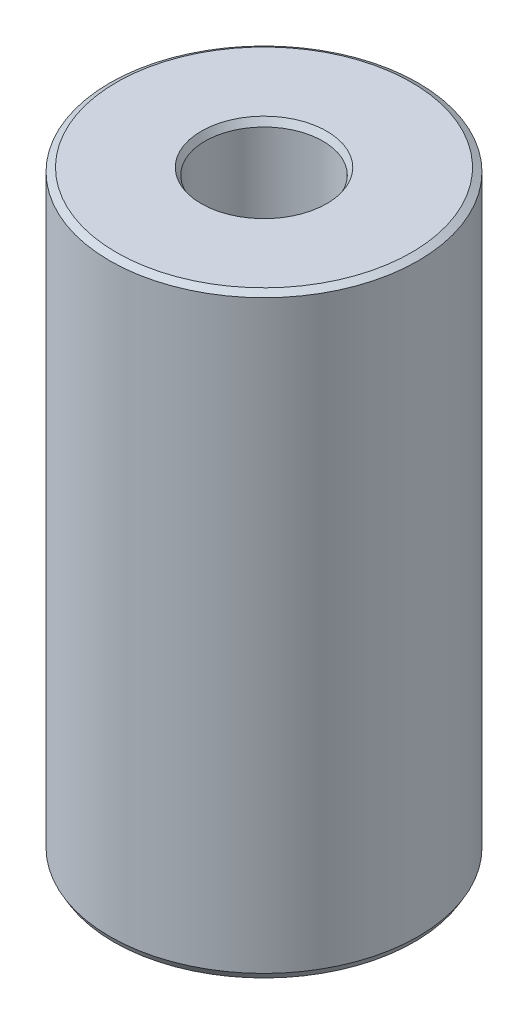
ISO-10303-21;
HEADER;
FILE_DESCRIPTION(('STEP AP214'),'2;1');
FILE_NAME('part.step','',(''),(''),'','','');
FILE_SCHEMA(('AUTOMOTIVE_DESIGN { 1 0 10303 214 1 1 1 1 }'));
ENDSEC;
DATA;
#1=APPLICATION_CONTEXT('core data for automotive mechanical design processes');
#2=APPLICATION_PROTOCOL_DEFINITION('international standard','automotive_design',2000,#1);
#3=PRODUCT_CONTEXT('',#1,'mechanical');
#4=PRODUCT('Part','Part','',(#3));
#5=PRODUCT_RELATED_PRODUCT_CATEGORY('part','',(#4));
#6=PRODUCT_DEFINITION_FORMATION('','',#4);
#7=PRODUCT_DEFINITION_CONTEXT('part definition',#1,'design');
#8=PRODUCT_DEFINITION('design','',#6,#7);
#9=PRODUCT_DEFINITION_SHAPE('','',#8);
#10=(LENGTH_UNIT() NAMED_UNIT(*) SI_UNIT(.MILLI.,.METRE.));
#11=(NAMED_UNIT(*) PLANE_ANGLE_UNIT() SI_UNIT($,.RADIAN.));
#12=(NAMED_UNIT(*) SI_UNIT($,.STERADIAN.) SOLID_ANGLE_UNIT());
#13=UNCERTAINTY_MEASURE_WITH_UNIT(LENGTH_MEASURE(1.E-05),#10,'distance_accuracy_value','');
#14=(GEOMETRIC_REPRESENTATION_CONTEXT(3) GLOBAL_UNCERTAINTY_ASSIGNED_CONTEXT((#13)) GLOBAL_UNIT_ASSIGNED_CONTEXT((#10,
#11,#12)) REPRESENTATION_CONTEXT('',''));
#15=CARTESIAN_POINT('',(0.,0.,0.));
#16=DIRECTION('',(0.,0.,1.));
#17=DIRECTION('',(1.,0.,0.));
#18=AXIS2_PLACEMENT_3D('',#15,#16,#17);
#19=CARTESIAN_POINT('',(0.,38.6476704867657,0.));
#20=DIRECTION('',(0.,-1.,0.));
#21=DIRECTION('',(0.,0.,-1.));
#22=AXIS2_PLACEMENT_3D('',#19,#20,#21);
#23=CYLINDRICAL_SURFACE('',#22,10.);
#24=CARTESIAN_POINT('',(0.,0.433010156777346,0.));
#25=DIRECTION('',(0.,1.,0.));
#26=DIRECTION('',(0.,0.,1.));
#27=AXIS2_PLACEMENT_3D('',#24,#25,#26);
#28=CIRCLE('',#27,10.);
#29=CARTESIAN_POINT('',(0.,0.433010156777346,10.));
#30=VERTEX_POINT('',#29);
#31=EDGE_CURVE('E10',#30,#30,#28,.T.);
#32=ORIENTED_EDGE('',*,*,#31,.T.);
#33=EDGE_LOOP('',(#32));
#34=FACE_BOUND('',#33,.T.);
#35=CARTESIAN_POINT('',(0.,38.3976719561885,0.));
#36=DIRECTION('',(0.,1.,0.));
#37=DIRECTION('',(0.,0.,1.));
#38=AXIS2_PLACEMENT_3D('',#35,#36,#37);
#39=CIRCLE('',#38,10.);
#40=CARTESIAN_POINT('',(0.,38.3976719561885,10.));
#41=VERTEX_POINT('',#40);
#42=EDGE_CURVE('E50',#41,#41,#39,.F.);
#43=ORIENTED_EDGE('',*,*,#42,.T.);
#44=EDGE_LOOP('',(#43));
#45=FACE_BOUND('',#44,.T.);
#46=ADVANCED_FACE('F39',(#34,#45),#23,.T.);
#47=CARTESIAN_POINT('',(0.,38.6476704867657,0.));
#48=DIRECTION('',(0.,1.,0.));
#49=DIRECTION('',(0.,0.,1.));
#50=AXIS2_PLACEMENT_3D('',#47,#48,#49);
#51=PLANE('',#50);
#52=CARTESIAN_POINT('',(0.,38.6476704867657,0.));
#53=DIRECTION('',(0.,1.,0.));
#54=DIRECTION('',(0.,0.,1.));
#55=AXIS2_PLACEMENT_3D('',#52,#53,#54);
#56=CIRCLE('',#55,4.07374202861867);
#57=CARTESIAN_POINT('',(0.,38.6476704867657,4.07374202861867));
#58=VERTEX_POINT('',#57);
#59=EDGE_CURVE('E58',#58,#58,#56,.F.);
#60=ORIENTED_EDGE('',*,*,#59,.T.);
#61=EDGE_LOOP('',(#60));
#62=FACE_BOUND('',#61,.T.);
#63=CARTESIAN_POINT('',(0.,38.6476704867657,0.));
#64=DIRECTION('',(0.,1.,0.));
#65=DIRECTION('',(0.,0.,1.));
#66=AXIS2_PLACEMENT_3D('',#63,#64,#65);
#67=CIRCLE('',#66,9.56698984322266);
#68=CARTESIAN_POINT('',(0.,38.6476704867657,9.56698984322266));
#69=VERTEX_POINT('',#68);
#70=EDGE_CURVE('E61',#69,#69,#67,.T.);
#71=ORIENTED_EDGE('',*,*,#70,.T.);
#72=EDGE_LOOP('',(#71));
#73=FACE_BOUND('',#72,.T.);
#74=ADVANCED_FACE('F88',(#62,#73),#51,.T.);
#75=CARTESIAN_POINT('',(0.,0.,0.));
#76=DIRECTION('',(0.,1.,0.));
#77=DIRECTION('',(0.,0.,1.));
#78=AXIS2_PLACEMENT_3D('',#75,#76,#77);
#79=PLANE('',#78);
#80=CARTESIAN_POINT('',(0.,0.,0.));
#81=DIRECTION('',(0.,1.,0.));
#82=DIRECTION('',(0.,0.,1.));
#83=AXIS2_PLACEMENT_3D('',#80,#81,#82);
#84=CIRCLE('',#83,4.25675365481877);
#85=CARTESIAN_POINT('',(0.,0.,4.25675365481877));
#86=VERTEX_POINT('',#85);
#87=EDGE_CURVE('E51',#86,#86,#84,.T.);
#88=ORIENTED_EDGE('',*,*,#87,.T.);
#89=EDGE_LOOP('',(#88));
#90=FACE_BOUND('',#89,.T.);
#91=CARTESIAN_POINT('',(0.,0.,0.));
#92=DIRECTION('',(0.,1.,0.));
#93=DIRECTION('',(0.,0.,1.));
#94=AXIS2_PLACEMENT_3D('',#91,#92,#93);
#95=CIRCLE('',#94,9.75000146942276);
#96=CARTESIAN_POINT('',(0.,0.,9.75000146942276));
#97=VERTEX_POINT('',#96);
#98=EDGE_CURVE('E54',#97,#97,#95,.F.);
#99=ORIENTED_EDGE('',*,*,#98,.T.);
#100=EDGE_LOOP('',(#99));
#101=FACE_BOUND('',#100,.T.);
#102=ADVANCED_FACE('F83',(#90,#101),#79,.F.);
#103=CARTESIAN_POINT('',(0.,38.6476704867657,0.));
#104=DIRECTION('',(0.,-1.,0.));
#105=DIRECTION('',(0.,0.,-1.));
#106=AXIS2_PLACEMENT_3D('',#103,#104,#105);
#107=CYLINDRICAL_SURFACE('',#106,3.82374349804143);
#108=CARTESIAN_POINT('',(0.,38.2146603299883,0.));
#109=DIRECTION('',(0.,1.,0.));
#110=DIRECTION('',(0.,0.,1.));
#111=AXIS2_PLACEMENT_3D('',#108,#109,#110);
#112=CIRCLE('',#111,3.82374349804143);
#113=CARTESIAN_POINT('',(0.,38.2146603299883,3.82374349804143));
#114=VERTEX_POINT('',#113);
#115=EDGE_CURVE('E67',#114,#114,#112,.T.);
#116=ORIENTED_EDGE('',*,*,#115,.T.);
#117=EDGE_LOOP('',(#116));
#118=FACE_BOUND('',#117,.T.);
#119=CARTESIAN_POINT('',(0.,0.249998530577236,0.));
#120=DIRECTION('',(0.,1.,0.));
#121=DIRECTION('',(0.,0.,1.));
#122=AXIS2_PLACEMENT_3D('',#119,#120,#121);
#123=CIRCLE('',#122,3.82374349804143);
#124=CARTESIAN_POINT('',(0.,0.249998530577236,3.82374349804143));
#125=VERTEX_POINT('',#124);
#126=EDGE_CURVE('E69',#125,#125,#123,.F.);
#127=ORIENTED_EDGE('',*,*,#126,.T.);
#128=EDGE_LOOP('',(#127));
#129=FACE_BOUND('',#128,.T.);
#130=ADVANCED_FACE('F71',(#118,#129),#107,.F.);
#131=CARTESIAN_POINT('',(0.,38.2146603299883,0.));
#132=DIRECTION('',(0.,1.,0.));
#133=DIRECTION('',(0.,0.,1.));
#134=AXIS2_PLACEMENT_3D('',#131,#132,#133);
#135=CONICAL_SURFACE('',#134,3.82374349804143,0.523598775598295);
#136=CARTESIAN_POINT('',(0.,38.6476704867657,4.07374202861867));
#137=CARTESIAN_POINT('',(0.,38.6431599642993,4.07113787725849));
#138=CARTESIAN_POINT('',(0.,38.6386494418328,4.06853372589831));
#139=CARTESIAN_POINT('',(0.,38.6296283969,4.06332542317795));
#140=CARTESIAN_POINT('',(0.,38.6251178744335,4.06072127181777));
#141=CARTESIAN_POINT('',(0.,38.6160968295007,4.05551296909742));
#142=CARTESIAN_POINT('',(0.,38.6115863070343,4.05290881773724));
#143=CARTESIAN_POINT('',(0.,38.6025652621014,4.04770051501688));
#144=CARTESIAN_POINT('',(0.,38.598054739635,4.0450963636567));
#145=CARTESIAN_POINT('',(0.,38.5890336947021,4.03988806093634));
#146=CARTESIAN_POINT('',(0.,38.5845231722357,4.03728390957616));
#147=CARTESIAN_POINT('',(0.,38.5755021273028,4.0320756068558));
#148=CARTESIAN_POINT('',(0.,38.5709916048364,4.02947145549562));
#149=CARTESIAN_POINT('',(0.,38.5619705599035,4.02426315277526));
#150=CARTESIAN_POINT('',(0.,38.5574600374371,4.02165900141508));
#151=CARTESIAN_POINT('',(0.,38.5484389925042,4.01645069869472));
#152=CARTESIAN_POINT('',(0.,38.5439284700378,4.01384654733454));
#153=CARTESIAN_POINT('',(0.,38.5349074251049,4.00863824461418));
#154=CARTESIAN_POINT('',(0.,38.5303969026385,4.006034093254));
#155=CARTESIAN_POINT('',(0.,38.5213758577056,4.00082579053364));
#156=CARTESIAN_POINT('',(0.,38.5168653352392,3.99822163917346));
#157=CARTESIAN_POINT('',(0.,38.5078442903063,3.9930133364531));
#158=CARTESIAN_POINT('',(0.,38.5033337678399,3.99040918509292));
#159=CARTESIAN_POINT('',(0.,38.494312722907,3.98520088237257));
#160=CARTESIAN_POINT('',(0.,38.4898022004406,3.98259673101239));
#161=CARTESIAN_POINT('',(0.,38.4807811555078,3.97738842829203));
#162=CARTESIAN_POINT('',(0.,38.4762706330413,3.97478427693185));
#163=CARTESIAN_POINT('',(0.,38.4672495881085,3.96957597421149));
#164=CARTESIAN_POINT('',(0.,38.462739065642,3.96697182285131));
#165=CARTESIAN_POINT('',(0.,38.4537180207092,3.96176352013095));
#166=CARTESIAN_POINT('',(0.,38.4492074982427,3.95915936877077));
#167=CARTESIAN_POINT('',(0.,38.4401864533099,3.95395106605041));
#168=CARTESIAN_POINT('',(0.,38.4356759308435,3.95134691469023));
#169=CARTESIAN_POINT('',(0.,38.4266548859106,3.94613861196987));
#170=CARTESIAN_POINT('',(0.,38.4221443634442,3.94353446060969));
#171=CARTESIAN_POINT('',(0.,38.4131233185113,3.93832615788933));
#172=CARTESIAN_POINT('',(0.,38.4086127960449,3.93572200652915));
#173=CARTESIAN_POINT('',(0.,38.399591751112,3.93051370380879));
#174=CARTESIAN_POINT('',(0.,38.3950812286456,3.92790955244861));
#175=CARTESIAN_POINT('',(0.,38.3860601837127,3.92270124972826));
#176=CARTESIAN_POINT('',(0.,38.3815496612463,3.92009709836807));
#177=CARTESIAN_POINT('',(0.,38.3725286163134,3.91488879564772));
#178=CARTESIAN_POINT('',(0.,38.368018093847,3.91228464428754));
#179=CARTESIAN_POINT('',(0.,38.3589970489141,3.90707634156718));
#180=CARTESIAN_POINT('',(0.,38.3544865264477,3.904472190207));
#181=CARTESIAN_POINT('',(0.,38.3454654815148,3.89926388748664));
#182=CARTESIAN_POINT('',(0.,38.3409549590484,3.89665973612646));
#183=CARTESIAN_POINT('',(0.,38.3319339141155,3.8914514334061));
#184=CARTESIAN_POINT('',(0.,38.3274233916491,3.88884728204592));
#185=CARTESIAN_POINT('',(0.,38.3184023467162,3.88363897932556));
#186=CARTESIAN_POINT('',(0.,38.3138918242498,3.88103482796538));
#187=CARTESIAN_POINT('',(0.,38.304870779317,3.87582652524502));
#188=CARTESIAN_POINT('',(0.,38.3003602568505,3.87322237388484));
#189=CARTESIAN_POINT('',(0.,38.2913392119177,3.86801407116448));
#190=CARTESIAN_POINT('',(0.,38.2868286894512,3.8654099198043));
#191=CARTESIAN_POINT('',(0.,38.2778076445184,3.86020161708394));
#192=CARTESIAN_POINT('',(0.,38.2732971220519,3.85759746572376));
#193=CARTESIAN_POINT('',(0.,38.2642760771191,3.8523891630034));
#194=CARTESIAN_POINT('',(0.,38.2597655546527,3.84978501164323));
#195=CARTESIAN_POINT('',(0.,38.2507445097198,3.84457670892287));
#196=CARTESIAN_POINT('',(0.,38.2462339872534,3.84197255756269));
#197=CARTESIAN_POINT('',(0.,38.2372129423205,3.83676425484233));
#198=CARTESIAN_POINT('',(0.,38.2327024198541,3.83416010348215));
#199=CARTESIAN_POINT('',(0.,38.2236813749212,3.82895180076179));
#200=CARTESIAN_POINT('',(0.,38.2191708524548,3.82634764940161));
#201=CARTESIAN_POINT('',(0.,38.2146603299883,3.82374349804143));
#202=B_SPLINE_CURVE_WITH_KNOTS('',3,(#136,#137,#138,#139,#140,#141,#142,#143,#144,#145,#146,
#147,#148,#149,#150,#151,#152,#153,#154,#155,#156,#157,#158,#159,#160,#161,#162,#163,#164,#165,
#166,#167,#168,#169,#170,#171,#172,#173,#174,#175,#176,#177,#178,#179,#180,#181,#182,#183,#184,
#185,#186,#187,#188,#189,#190,#191,#192,#193,#194,#195,#196,#197,#198,#199,#200,#201),
.UNSPECIFIED.,.F.,.F.,(4,2,2,2,2,2,2,2,2,2,2,2,2,2,2,2,2,2,2,2,2,2,2,2,2,2,2,2,2,2,2,2,4),(0.,
0.0156249081610832,0.0312498163221604,0.0468747244832377,0.0624996326443144,0.0781245408053916,
0.0937494489664689,0.109374357127546,0.124999265288623,0.140624173449706,0.156249081610783,
0.17187398977186,0.187498897932938,0.203123806094015,0.218748714255092,0.234373622416169,
0.249998530577246,0.265623438738329,0.281248346899407,0.296873255060483,0.312498163221561,
0.328123071382638,0.343747979543715,0.359372887704792,0.374997795865875,0.390622704026952,
0.406247612188029,0.421872520349107,0.437497428510184,0.453122336671261,0.468747244832338,
0.484372152993415,0.499997061154492),.UNSPECIFIED.);
#203=EDGE_CURVE('BSEAM77',#58,#114,#202,.T.);
#204=ORIENTED_EDGE('',*,*,#59,.F.);
#205=ORIENTED_EDGE('',*,*,#115,.F.);
#206=ORIENTED_EDGE('',*,*,#203,.T.);
#207=ORIENTED_EDGE('',*,*,#203,.F.);
#208=EDGE_LOOP('',(#204,#206,#205,#207));
#209=FACE_BOUND('',#208,.T.);
#210=ADVANCED_FACE('F77',(#209),#135,.F.);
#211=CARTESIAN_POINT('',(0.,0.,0.));
#212=DIRECTION('',(0.,-1.,0.));
#213=DIRECTION('',(0.,0.,-1.));
#214=AXIS2_PLACEMENT_3D('',#211,#212,#213);
#215=CONICAL_SURFACE('',#214,4.25675365481877,1.0471975511966);
#216=ORIENTED_EDGE('',*,*,#126,.F.);
#217=EDGE_LOOP('',(#216));
#218=FACE_BOUND('',#217,.T.);
#219=ORIENTED_EDGE('',*,*,#87,.F.);
#220=EDGE_LOOP('',(#219));
#221=FACE_BOUND('',#220,.T.);
#222=ADVANCED_FACE('F73',(#218,#221),#215,.F.);
#223=CARTESIAN_POINT('',(0.,0.433010156777346,0.));
#224=DIRECTION('',(0.,1.,0.));
#225=DIRECTION('',(0.,0.,1.));
#226=AXIS2_PLACEMENT_3D('',#223,#224,#225);
#227=CONICAL_SURFACE('',#226,10.,0.523598775598303);
#228=ORIENTED_EDGE('',*,*,#98,.F.);
#229=EDGE_LOOP('',(#228));
#230=FACE_BOUND('',#229,.T.);
#231=ORIENTED_EDGE('',*,*,#31,.F.);
#232=EDGE_LOOP('',(#231));
#233=FACE_BOUND('',#232,.T.);
#234=ADVANCED_FACE('F76',(#230,#233),#227,.T.);
#235=CARTESIAN_POINT('',(0.,38.6476704867657,0.));
#236=DIRECTION('',(0.,-1.,0.));
#237=DIRECTION('',(0.,0.,-1.));
#238=AXIS2_PLACEMENT_3D('',#235,#236,#237);
#239=CONICAL_SURFACE('',#238,9.56698984322266,1.04719755119659);
#240=ORIENTED_EDGE('',*,*,#42,.F.);
#241=EDGE_LOOP('',(#240));
#242=FACE_BOUND('',#241,.T.);
#243=ORIENTED_EDGE('',*,*,#70,.F.);
#244=EDGE_LOOP('',(#243));
#245=FACE_BOUND('',#244,.T.);
#246=ADVANCED_FACE('F45',(#242,#245),#239,.T.);
#247=CLOSED_SHELL('',(#46,#74,#102,#130,#210,#222,#234,#246));
#248=MANIFOLD_SOLID_BREP('B2',#247);
#249=ADVANCED_BREP_SHAPE_REPRESENTATION('',(#18,#248),#14);
#250=SHAPE_DEFINITION_REPRESENTATION(#9,#249);
ENDSEC;
END-ISO-10303-21;
